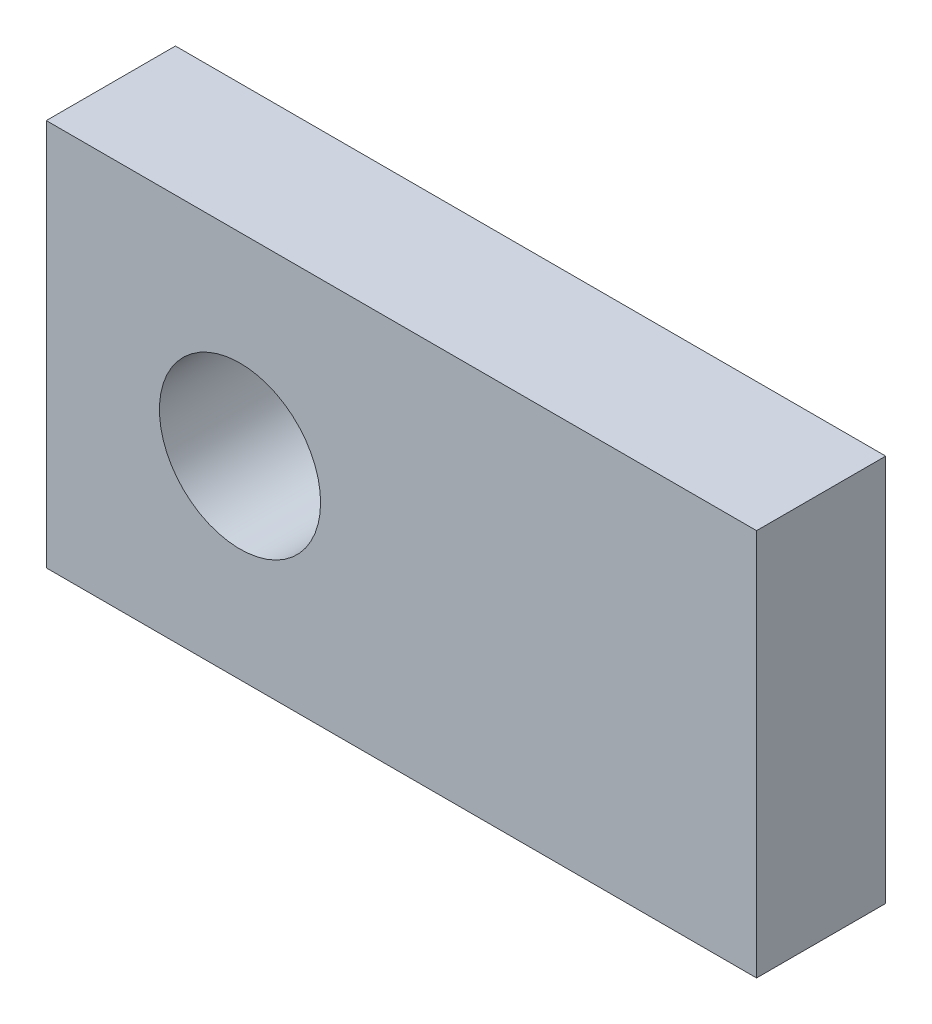
ISO-10303-21;
HEADER;
FILE_DESCRIPTION(('STEP AP214'),'2;1');
FILE_NAME('part.step','',(''),(''),'','','');
FILE_SCHEMA(('AUTOMOTIVE_DESIGN { 1 0 10303 214 1 1 1 1 }'));
ENDSEC;
DATA;
#1=APPLICATION_CONTEXT('core data for automotive mechanical design processes');
#2=APPLICATION_PROTOCOL_DEFINITION('international standard','automotive_design',2000,#1);
#3=PRODUCT_CONTEXT('',#1,'mechanical');
#4=PRODUCT('Part','Part','',(#3));
#5=PRODUCT_RELATED_PRODUCT_CATEGORY('part','',(#4));
#6=PRODUCT_DEFINITION_FORMATION('','',#4);
#7=PRODUCT_DEFINITION_CONTEXT('part definition',#1,'design');
#8=PRODUCT_DEFINITION('design','',#6,#7);
#9=PRODUCT_DEFINITION_SHAPE('','',#8);
#10=(LENGTH_UNIT() NAMED_UNIT(*) SI_UNIT(.MILLI.,.METRE.));
#11=(NAMED_UNIT(*) PLANE_ANGLE_UNIT() SI_UNIT($,.RADIAN.));
#12=(NAMED_UNIT(*) SI_UNIT($,.STERADIAN.) SOLID_ANGLE_UNIT());
#13=UNCERTAINTY_MEASURE_WITH_UNIT(LENGTH_MEASURE(1.E-05),#10,'distance_accuracy_value','');
#14=(GEOMETRIC_REPRESENTATION_CONTEXT(3) GLOBAL_UNCERTAINTY_ASSIGNED_CONTEXT((#13)) GLOBAL_UNIT_ASSIGNED_CONTEXT((#10,
#11,#12)) REPRESENTATION_CONTEXT('',''));
#15=CARTESIAN_POINT('',(0.,0.,0.));
#16=DIRECTION('',(0.,0.,1.));
#17=DIRECTION('',(1.,0.,0.));
#18=AXIS2_PLACEMENT_3D('',#15,#16,#17);
#19=CARTESIAN_POINT('',(0.,0.,6.35));
#20=DIRECTION('',(0.,0.,1.));
#21=DIRECTION('',(1.,0.,0.));
#22=AXIS2_PLACEMENT_3D('',#19,#20,#21);
#23=PLANE('',#22);
#24=DIRECTION('',(0.,-1.,0.));
#25=VECTOR('',#24,1.);
#26=CARTESIAN_POINT('',(-9.525,9.525,6.35));
#27=LINE('',#26,#25);
#28=CARTESIAN_POINT('',(-9.525,9.525,6.35));
#29=VERTEX_POINT('',#28);
#30=CARTESIAN_POINT('',(-9.525,-9.525,6.35));
#31=VERTEX_POINT('',#30);
#32=EDGE_CURVE('E92',#29,#31,#27,.T.);
#33=ORIENTED_EDGE('',*,*,#32,.T.);
#34=DIRECTION('',(1.,0.,0.));
#35=VECTOR('',#34,1.);
#36=CARTESIAN_POINT('',(-9.525,-9.525,6.35));
#37=LINE('',#36,#35);
#38=CARTESIAN_POINT('',(25.4,-9.525,6.35));
#39=VERTEX_POINT('',#38);
#40=EDGE_CURVE('E87',#31,#39,#37,.T.);
#41=ORIENTED_EDGE('',*,*,#40,.T.);
#42=DIRECTION('',(0.,1.,0.));
#43=VECTOR('',#42,1.);
#44=CARTESIAN_POINT('',(25.4,9.525,6.35));
#45=LINE('',#44,#43);
#46=CARTESIAN_POINT('',(25.4,9.525,6.35));
#47=VERTEX_POINT('',#46);
#48=EDGE_CURVE('E90',#39,#47,#45,.T.);
#49=ORIENTED_EDGE('',*,*,#48,.T.);
#50=DIRECTION('',(-1.,0.,0.));
#51=VECTOR('',#50,1.);
#52=CARTESIAN_POINT('',(-9.525,9.525,6.35));
#53=LINE('',#52,#51);
#54=EDGE_CURVE('E57',#47,#29,#53,.T.);
#55=ORIENTED_EDGE('',*,*,#54,.T.);
#56=EDGE_LOOP('',(#33,#41,#49,#55));
#57=FACE_BOUND('',#56,.T.);
#58=CARTESIAN_POINT('',(0.,0.,6.35));
#59=DIRECTION('',(0.,0.,1.));
#60=DIRECTION('',(1.,0.,0.));
#61=AXIS2_PLACEMENT_3D('',#58,#59,#60);
#62=CIRCLE('',#61,3.9624);
#63=CARTESIAN_POINT('',(3.9624,0.,6.35));
#64=VERTEX_POINT('',#63);
#65=EDGE_CURVE('E112',#64,#64,#62,.T.);
#66=ORIENTED_EDGE('',*,*,#65,.F.);
#67=EDGE_LOOP('',(#66));
#68=FACE_BOUND('',#67,.T.);
#69=ADVANCED_FACE('F39',(#57,#68),#23,.T.);
#70=CARTESIAN_POINT('',(0.,0.,0.));
#71=DIRECTION('',(0.,0.,1.));
#72=DIRECTION('',(1.,0.,0.));
#73=AXIS2_PLACEMENT_3D('',#70,#71,#72);
#74=PLANE('',#73);
#75=DIRECTION('',(0.,-1.,0.));
#76=VECTOR('',#75,1.);
#77=CARTESIAN_POINT('',(-9.525,9.525,0.));
#78=LINE('',#77,#76);
#79=CARTESIAN_POINT('',(-9.525,9.525,0.));
#80=VERTEX_POINT('',#79);
#81=CARTESIAN_POINT('',(-9.525,-9.525,0.));
#82=VERTEX_POINT('',#81);
#83=EDGE_CURVE('E108',#80,#82,#78,.T.);
#84=ORIENTED_EDGE('',*,*,#83,.F.);
#85=DIRECTION('',(-1.,0.,0.));
#86=VECTOR('',#85,1.);
#87=CARTESIAN_POINT('',(-9.525,9.525,0.));
#88=LINE('',#87,#86);
#89=CARTESIAN_POINT('',(25.4,9.525,0.));
#90=VERTEX_POINT('',#89);
#91=EDGE_CURVE('E80',#90,#80,#88,.T.);
#92=ORIENTED_EDGE('',*,*,#91,.F.);
#93=DIRECTION('',(0.,1.,0.));
#94=VECTOR('',#93,1.);
#95=CARTESIAN_POINT('',(25.4,9.525,0.));
#96=LINE('',#95,#94);
#97=CARTESIAN_POINT('',(25.4,-9.525,0.));
#98=VERTEX_POINT('',#97);
#99=EDGE_CURVE('E74',#98,#90,#96,.T.);
#100=ORIENTED_EDGE('',*,*,#99,.F.);
#101=DIRECTION('',(1.,0.,0.));
#102=VECTOR('',#101,1.);
#103=CARTESIAN_POINT('',(-9.525,-9.525,0.));
#104=LINE('',#103,#102);
#105=EDGE_CURVE('E97',#82,#98,#104,.T.);
#106=ORIENTED_EDGE('',*,*,#105,.F.);
#107=EDGE_LOOP('',(#84,#92,#100,#106));
#108=FACE_BOUND('',#107,.T.);
#109=CARTESIAN_POINT('',(0.,0.,0.));
#110=DIRECTION('',(0.,0.,1.));
#111=DIRECTION('',(1.,0.,0.));
#112=AXIS2_PLACEMENT_3D('',#109,#110,#111);
#113=CIRCLE('',#112,3.9624);
#114=CARTESIAN_POINT('',(3.9624,0.,0.));
#115=VERTEX_POINT('',#114);
#116=EDGE_CURVE('E130',#115,#115,#113,.T.);
#117=ORIENTED_EDGE('',*,*,#116,.T.);
#118=EDGE_LOOP('',(#117));
#119=FACE_BOUND('',#118,.T.);
#120=ADVANCED_FACE('F125',(#108,#119),#74,.F.);
#121=CARTESIAN_POINT('',(-9.525,9.525,6.35));
#122=DIRECTION('',(1.,0.,0.));
#123=DIRECTION('',(0.,1.,0.));
#124=AXIS2_PLACEMENT_3D('',#121,#122,#123);
#125=PLANE('',#124);
#126=ORIENTED_EDGE('',*,*,#83,.T.);
#127=DIRECTION('',(0.,0.,-1.));
#128=VECTOR('',#127,1.);
#129=CARTESIAN_POINT('',(-9.525,-9.525,6.35));
#130=LINE('',#129,#128);
#131=EDGE_CURVE('E11',#31,#82,#130,.T.);
#132=ORIENTED_EDGE('',*,*,#131,.F.);
#133=ORIENTED_EDGE('',*,*,#32,.F.);
#134=DIRECTION('',(0.,0.,-1.));
#135=VECTOR('',#134,1.);
#136=CARTESIAN_POINT('',(-9.525,9.525,6.35));
#137=LINE('',#136,#135);
#138=EDGE_CURVE('E104',#29,#80,#137,.T.);
#139=ORIENTED_EDGE('',*,*,#138,.T.);
#140=EDGE_LOOP('',(#126,#132,#133,#139));
#141=FACE_BOUND('',#140,.T.);
#142=ADVANCED_FACE('F41',(#141),#125,.F.);
#143=CARTESIAN_POINT('',(-9.525,-9.525,6.35));
#144=DIRECTION('',(0.,1.,0.));
#145=DIRECTION('',(0.,0.,1.));
#146=AXIS2_PLACEMENT_3D('',#143,#144,#145);
#147=PLANE('',#146);
#148=ORIENTED_EDGE('',*,*,#105,.T.);
#149=DIRECTION('',(0.,0.,-1.));
#150=VECTOR('',#149,1.);
#151=CARTESIAN_POINT('',(25.4,-9.525,6.35));
#152=LINE('',#151,#150);
#153=EDGE_CURVE('E49',#39,#98,#152,.T.);
#154=ORIENTED_EDGE('',*,*,#153,.F.);
#155=ORIENTED_EDGE('',*,*,#40,.F.);
#156=ORIENTED_EDGE('',*,*,#131,.T.);
#157=EDGE_LOOP('',(#148,#154,#155,#156));
#158=FACE_BOUND('',#157,.T.);
#159=ADVANCED_FACE('F96',(#158),#147,.F.);
#160=CARTESIAN_POINT('',(25.4,9.525,6.35));
#161=DIRECTION('',(-1.,0.,0.));
#162=DIRECTION('',(0.,-1.,0.));
#163=AXIS2_PLACEMENT_3D('',#160,#161,#162);
#164=PLANE('',#163);
#165=ORIENTED_EDGE('',*,*,#99,.T.);
#166=DIRECTION('',(0.,0.,-1.));
#167=VECTOR('',#166,1.);
#168=CARTESIAN_POINT('',(25.4,9.525,6.35));
#169=LINE('',#168,#167);
#170=EDGE_CURVE('E99',#47,#90,#169,.T.);
#171=ORIENTED_EDGE('',*,*,#170,.F.);
#172=ORIENTED_EDGE('',*,*,#48,.F.);
#173=ORIENTED_EDGE('',*,*,#153,.T.);
#174=EDGE_LOOP('',(#165,#171,#172,#173));
#175=FACE_BOUND('',#174,.T.);
#176=ADVANCED_FACE('F100',(#175),#164,.F.);
#177=CARTESIAN_POINT('',(-9.525,9.525,6.35));
#178=DIRECTION('',(0.,-1.,0.));
#179=DIRECTION('',(0.,0.,-1.));
#180=AXIS2_PLACEMENT_3D('',#177,#178,#179);
#181=PLANE('',#180);
#182=ORIENTED_EDGE('',*,*,#91,.T.);
#183=ORIENTED_EDGE('',*,*,#138,.F.);
#184=ORIENTED_EDGE('',*,*,#54,.F.);
#185=ORIENTED_EDGE('',*,*,#170,.T.);
#186=EDGE_LOOP('',(#182,#183,#184,#185));
#187=FACE_BOUND('',#186,.T.);
#188=ADVANCED_FACE('F122',(#187),#181,.F.);
#189=CARTESIAN_POINT('',(0.,0.,6.35));
#190=DIRECTION('',(0.,0.,-1.));
#191=DIRECTION('',(-1.,0.,0.));
#192=AXIS2_PLACEMENT_3D('',#189,#190,#191);
#193=CYLINDRICAL_SURFACE('',#192,3.9624);
#194=ORIENTED_EDGE('',*,*,#65,.T.);
#195=EDGE_LOOP('',(#194));
#196=FACE_BOUND('',#195,.T.);
#197=ORIENTED_EDGE('',*,*,#116,.F.);
#198=EDGE_LOOP('',(#197));
#199=FACE_BOUND('',#198,.T.);
#200=ADVANCED_FACE('F138',(#196,#199),#193,.F.);
#201=CLOSED_SHELL('',(#69,#120,#142,#159,#176,#188,#200));
#202=MANIFOLD_SOLID_BREP('B2',#201);
#203=ADVANCED_BREP_SHAPE_REPRESENTATION('',(#18,#202),#14);
#204=SHAPE_DEFINITION_REPRESENTATION(#9,#203);
ENDSEC;
END-ISO-10303-21;
